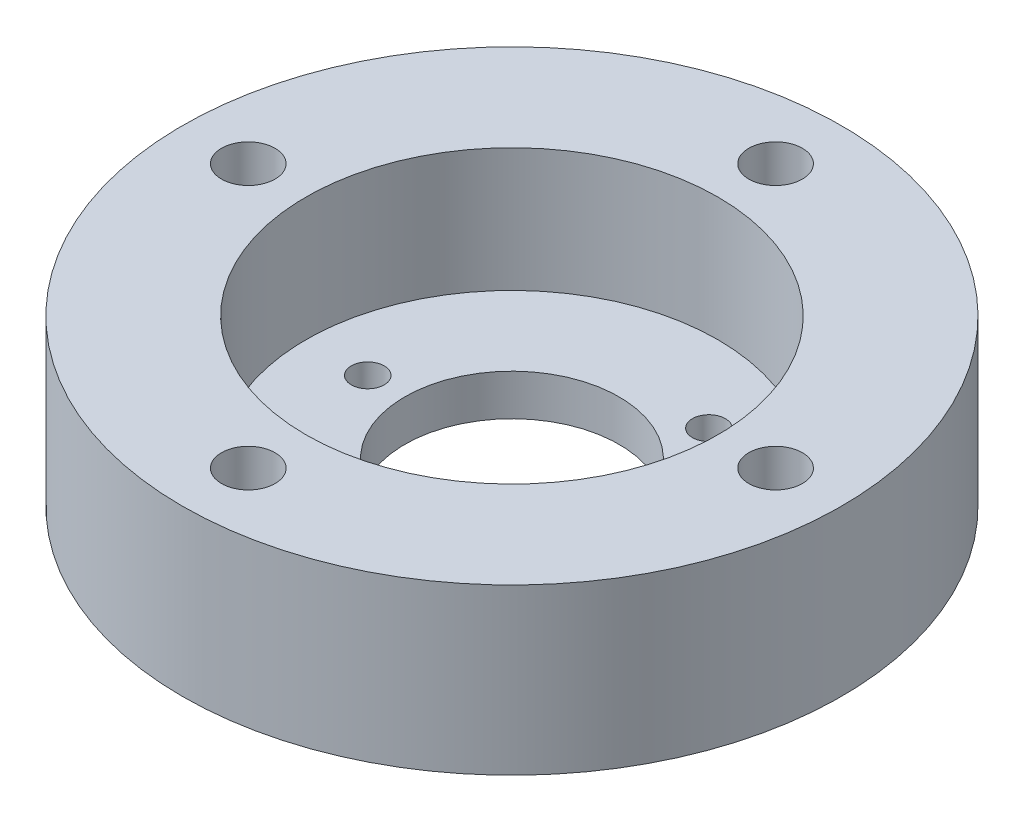
ISO-10303-21;
HEADER;
FILE_DESCRIPTION(('STEP AP214'),'2;1');
FILE_NAME('part.step','',(''),(''),'','','');
FILE_SCHEMA(('AUTOMOTIVE_DESIGN { 1 0 10303 214 1 1 1 1 }'));
ENDSEC;
DATA;
#1=APPLICATION_CONTEXT('core data for automotive mechanical design processes');
#2=APPLICATION_PROTOCOL_DEFINITION('international standard','automotive_design',2000,#1);
#3=PRODUCT_CONTEXT('',#1,'mechanical');
#4=PRODUCT('Part','Part','',(#3));
#5=PRODUCT_RELATED_PRODUCT_CATEGORY('part','',(#4));
#6=PRODUCT_DEFINITION_FORMATION('','',#4);
#7=PRODUCT_DEFINITION_CONTEXT('part definition',#1,'design');
#8=PRODUCT_DEFINITION('design','',#6,#7);
#9=PRODUCT_DEFINITION_SHAPE('','',#8);
#10=(LENGTH_UNIT() NAMED_UNIT(*) SI_UNIT(.MILLI.,.METRE.));
#11=(NAMED_UNIT(*) PLANE_ANGLE_UNIT() SI_UNIT($,.RADIAN.));
#12=(NAMED_UNIT(*) SI_UNIT($,.STERADIAN.) SOLID_ANGLE_UNIT());
#13=UNCERTAINTY_MEASURE_WITH_UNIT(LENGTH_MEASURE(1.E-05),#10,'distance_accuracy_value','');
#14=(GEOMETRIC_REPRESENTATION_CONTEXT(3) GLOBAL_UNCERTAINTY_ASSIGNED_CONTEXT((#13)) GLOBAL_UNIT_ASSIGNED_CONTEXT((#10,
#11,#12)) REPRESENTATION_CONTEXT('',''));
#15=CARTESIAN_POINT('',(0.,0.,0.));
#16=DIRECTION('',(0.,0.,1.));
#17=DIRECTION('',(1.,0.,0.));
#18=AXIS2_PLACEMENT_3D('',#15,#16,#17);
#19=CARTESIAN_POINT('',(40.,0.,0.));
#20=DIRECTION('',(0.,1.,0.));
#21=DIRECTION('',(0.,0.,1.));
#22=AXIS2_PLACEMENT_3D('',#19,#20,#21);
#23=PLANE('',#22);
#24=CARTESIAN_POINT('',(8.75000000000007,0.,15.1554445662276));
#25=DIRECTION('',(0.,1.,0.));
#26=DIRECTION('',(0.866025403784436,0.,-0.500000000000004));
#27=AXIS2_PLACEMENT_3D('',#24,#25,#26);
#28=CIRCLE('',#27,2.);
#29=CARTESIAN_POINT('',(10.4820508075689,0.,14.1554445662276));
#30=VERTEX_POINT('',#29);
#31=EDGE_CURVE('E63',#30,#30,#28,.T.);
#32=ORIENTED_EDGE('',*,*,#31,.T.);
#33=EDGE_LOOP('',(#32));
#34=FACE_BOUND('',#33,.T.);
#35=CARTESIAN_POINT('',(8.74999999999986,0.,-15.1554445662278));
#36=DIRECTION('',(0.,1.,0.));
#37=DIRECTION('',(-0.866025403784443,0.,-0.499999999999992));
#38=AXIS2_PLACEMENT_3D('',#35,#36,#37);
#39=CIRCLE('',#38,2.);
#40=CARTESIAN_POINT('',(7.01794919243097,0.,-16.1554445662277));
#41=VERTEX_POINT('',#40);
#42=EDGE_CURVE('E71',#41,#41,#39,.T.);
#43=ORIENTED_EDGE('',*,*,#42,.T.);
#44=EDGE_LOOP('',(#43));
#45=FACE_BOUND('',#44,.T.);
#46=CARTESIAN_POINT('',(-32.,0.,1.1172740284298E-13));
#47=DIRECTION('',(0.,1.,0.));
#48=DIRECTION('',(1.,0.,0.));
#49=AXIS2_PLACEMENT_3D('',#46,#47,#48);
#50=CIRCLE('',#49,3.25);
#51=CARTESIAN_POINT('',(-28.75,0.,1.0038008849174E-13));
#52=VERTEX_POINT('',#51);
#53=EDGE_CURVE('E79',#52,#52,#50,.T.);
#54=ORIENTED_EDGE('',*,*,#53,.T.);
#55=EDGE_LOOP('',(#54));
#56=FACE_BOUND('',#55,.T.);
#57=CARTESIAN_POINT('',(0.,0.,32.));
#58=DIRECTION('',(0.,1.,0.));
#59=DIRECTION('',(0.,0.,-1.));
#60=AXIS2_PLACEMENT_3D('',#57,#58,#59);
#61=CIRCLE('',#60,3.25);
#62=CARTESIAN_POINT('',(0.,0.,28.75));
#63=VERTEX_POINT('',#62);
#64=EDGE_CURVE('E88',#63,#63,#61,.T.);
#65=ORIENTED_EDGE('',*,*,#64,.T.);
#66=EDGE_LOOP('',(#65));
#67=FACE_BOUND('',#66,.T.);
#68=CARTESIAN_POINT('',(32.,0.,-3.35182208528941E-13));
#69=DIRECTION('',(0.,1.,0.));
#70=DIRECTION('',(-1.,0.,0.));
#71=AXIS2_PLACEMENT_3D('',#68,#69,#70);
#72=CIRCLE('',#71,3.25);
#73=CARTESIAN_POINT('',(28.75,0.,-3.0114026547522E-13));
#74=VERTEX_POINT('',#73);
#75=EDGE_CURVE('E96',#74,#74,#72,.T.);
#76=ORIENTED_EDGE('',*,*,#75,.T.);
#77=EDGE_LOOP('',(#76));
#78=FACE_BOUND('',#77,.T.);
#79=CARTESIAN_POINT('',(0.,0.,-32.));
#80=DIRECTION('',(0.,1.,0.));
#81=DIRECTION('',(0.,0.,1.));
#82=AXIS2_PLACEMENT_3D('',#79,#80,#81);
#83=CIRCLE('',#82,3.25);
#84=CARTESIAN_POINT('',(0.,0.,-28.75));
#85=VERTEX_POINT('',#84);
#86=EDGE_CURVE('E103',#85,#85,#83,.T.);
#87=ORIENTED_EDGE('',*,*,#86,.T.);
#88=EDGE_LOOP('',(#87));
#89=FACE_BOUND('',#88,.T.);
#90=CARTESIAN_POINT('',(-17.5,0.,0.));
#91=DIRECTION('',(0.,1.,0.));
#92=DIRECTION('',(0.,0.,1.));
#93=AXIS2_PLACEMENT_3D('',#90,#91,#92);
#94=CIRCLE('',#93,2.);
#95=CARTESIAN_POINT('',(-17.5,0.,2.));
#96=VERTEX_POINT('',#95);
#97=EDGE_CURVE('E59',#96,#96,#94,.T.);
#98=ORIENTED_EDGE('',*,*,#97,.T.);
#99=EDGE_LOOP('',(#98));
#100=FACE_BOUND('',#99,.T.);
#101=CARTESIAN_POINT('',(0.,0.,0.));
#102=DIRECTION('',(0.,1.,0.));
#103=DIRECTION('',(0.,0.,1.));
#104=AXIS2_PLACEMENT_3D('',#101,#102,#103);
#105=CIRCLE('',#104,40.);
#106=CARTESIAN_POINT('',(0.,0.,40.));
#107=VERTEX_POINT('',#106);
#108=EDGE_CURVE('E58',#107,#107,#105,.T.);
#109=ORIENTED_EDGE('',*,*,#108,.F.);
#110=EDGE_LOOP('',(#109));
#111=FACE_BOUND('',#110,.T.);
#112=CARTESIAN_POINT('',(0.,0.,0.));
#113=DIRECTION('',(0.,1.,0.));
#114=DIRECTION('',(0.,0.,1.));
#115=AXIS2_PLACEMENT_3D('',#112,#113,#114);
#116=CIRCLE('',#115,13.);
#117=CARTESIAN_POINT('',(0.,0.,13.));
#118=VERTEX_POINT('',#117);
#119=EDGE_CURVE('E10',#118,#118,#116,.T.);
#120=ORIENTED_EDGE('',*,*,#119,.T.);
#121=EDGE_LOOP('',(#120));
#122=FACE_BOUND('',#121,.T.);
#123=ADVANCED_FACE('F37',(#34,#45,#56,#67,#78,#89,#100,#111,#122),#23,.F.);
#124=CARTESIAN_POINT('',(0.,51.3950934422261,0.));
#125=DIRECTION('',(0.,1.,0.));
#126=DIRECTION('',(0.,0.,1.));
#127=AXIS2_PLACEMENT_3D('',#124,#125,#126);
#128=CYLINDRICAL_SURFACE('',#127,13.);
#129=ORIENTED_EDGE('',*,*,#119,.F.);
#130=EDGE_LOOP('',(#129));
#131=FACE_BOUND('',#130,.T.);
#132=CARTESIAN_POINT('',(0.,5.,0.));
#133=DIRECTION('',(0.,1.,0.));
#134=DIRECTION('',(0.,0.,1.));
#135=AXIS2_PLACEMENT_3D('',#132,#133,#134);
#136=CIRCLE('',#135,13.);
#137=CARTESIAN_POINT('',(0.,5.,13.));
#138=VERTEX_POINT('',#137);
#139=EDGE_CURVE('E45',#138,#138,#136,.T.);
#140=ORIENTED_EDGE('',*,*,#139,.T.);
#141=EDGE_LOOP('',(#140));
#142=FACE_BOUND('',#141,.T.);
#143=ADVANCED_FACE('F150',(#131,#142),#128,.F.);
#144=CARTESIAN_POINT('',(13.,5.,0.));
#145=DIRECTION('',(0.,-1.,0.));
#146=DIRECTION('',(0.,0.,-1.));
#147=AXIS2_PLACEMENT_3D('',#144,#145,#146);
#148=PLANE('',#147);
#149=CARTESIAN_POINT('',(8.75000000000007,5.,15.1554445662276));
#150=DIRECTION('',(0.,-1.,0.));
#151=DIRECTION('',(0.,0.,-1.));
#152=AXIS2_PLACEMENT_3D('',#149,#150,#151);
#153=CIRCLE('',#152,2.);
#154=CARTESIAN_POINT('',(8.75000000000007,5.,13.1554445662276));
#155=VERTEX_POINT('',#154);
#156=EDGE_CURVE('E40',#155,#155,#153,.T.);
#157=ORIENTED_EDGE('',*,*,#156,.T.);
#158=EDGE_LOOP('',(#157));
#159=FACE_BOUND('',#158,.T.);
#160=CARTESIAN_POINT('',(8.74999999999986,5.,-15.1554445662278));
#161=DIRECTION('',(0.,-1.,0.));
#162=DIRECTION('',(0.,0.,-1.));
#163=AXIS2_PLACEMENT_3D('',#160,#161,#162);
#164=CIRCLE('',#163,2.);
#165=CARTESIAN_POINT('',(8.74999999999986,5.,-17.1554445662278));
#166=VERTEX_POINT('',#165);
#167=EDGE_CURVE('E60',#166,#166,#164,.T.);
#168=ORIENTED_EDGE('',*,*,#167,.T.);
#169=EDGE_LOOP('',(#168));
#170=FACE_BOUND('',#169,.T.);
#171=CARTESIAN_POINT('',(-17.5,5.,0.));
#172=DIRECTION('',(0.,-1.,0.));
#173=DIRECTION('',(0.,0.,-1.));
#174=AXIS2_PLACEMENT_3D('',#171,#172,#173);
#175=CIRCLE('',#174,2.);
#176=CARTESIAN_POINT('',(-17.5,5.,-2.));
#177=VERTEX_POINT('',#176);
#178=EDGE_CURVE('E55',#177,#177,#175,.T.);
#179=ORIENTED_EDGE('',*,*,#178,.T.);
#180=EDGE_LOOP('',(#179));
#181=FACE_BOUND('',#180,.T.);
#182=ORIENTED_EDGE('',*,*,#139,.F.);
#183=EDGE_LOOP('',(#182));
#184=FACE_BOUND('',#183,.T.);
#185=CARTESIAN_POINT('',(0.,5.,0.));
#186=DIRECTION('',(0.,1.,0.));
#187=DIRECTION('',(0.,0.,1.));
#188=AXIS2_PLACEMENT_3D('',#185,#186,#187);
#189=CIRCLE('',#188,25.);
#190=CARTESIAN_POINT('',(0.,5.,25.));
#191=VERTEX_POINT('',#190);
#192=EDGE_CURVE('E51',#191,#191,#189,.T.);
#193=ORIENTED_EDGE('',*,*,#192,.T.);
#194=EDGE_LOOP('',(#193));
#195=FACE_BOUND('',#194,.T.);
#196=ADVANCED_FACE('F127',(#159,#170,#181,#184,#195),#148,.F.);
#197=CARTESIAN_POINT('',(0.,51.3950934422261,0.));
#198=DIRECTION('',(0.,1.,0.));
#199=DIRECTION('',(0.,0.,1.));
#200=AXIS2_PLACEMENT_3D('',#197,#198,#199);
#201=CYLINDRICAL_SURFACE('',#200,25.);
#202=ORIENTED_EDGE('',*,*,#192,.F.);
#203=EDGE_LOOP('',(#202));
#204=FACE_BOUND('',#203,.T.);
#205=CARTESIAN_POINT('',(0.,20.,0.));
#206=DIRECTION('',(0.,1.,0.));
#207=DIRECTION('',(0.,0.,1.));
#208=AXIS2_PLACEMENT_3D('',#205,#206,#207);
#209=CIRCLE('',#208,25.);
#210=CARTESIAN_POINT('',(0.,20.,25.));
#211=VERTEX_POINT('',#210);
#212=EDGE_CURVE('E120',#211,#211,#209,.T.);
#213=ORIENTED_EDGE('',*,*,#212,.T.);
#214=EDGE_LOOP('',(#213));
#215=FACE_BOUND('',#214,.T.);
#216=ADVANCED_FACE('F129',(#204,#215),#201,.F.);
#217=CARTESIAN_POINT('',(25.,20.,0.));
#218=DIRECTION('',(0.,-1.,0.));
#219=DIRECTION('',(0.,0.,-1.));
#220=AXIS2_PLACEMENT_3D('',#217,#218,#219);
#221=PLANE('',#220);
#222=CARTESIAN_POINT('',(-32.,20.,1.1172740284298E-13));
#223=DIRECTION('',(0.,1.,0.));
#224=DIRECTION('',(1.,0.,0.));
#225=AXIS2_PLACEMENT_3D('',#222,#223,#224);
#226=CIRCLE('',#225,3.25);
#227=CARTESIAN_POINT('',(-28.75,20.,1.0038008849174E-13));
#228=VERTEX_POINT('',#227);
#229=EDGE_CURVE('E84',#228,#228,#226,.T.);
#230=ORIENTED_EDGE('',*,*,#229,.F.);
#231=EDGE_LOOP('',(#230));
#232=FACE_BOUND('',#231,.T.);
#233=CARTESIAN_POINT('',(0.,20.,32.));
#234=DIRECTION('',(0.,1.,0.));
#235=DIRECTION('',(0.,0.,-1.));
#236=AXIS2_PLACEMENT_3D('',#233,#234,#235);
#237=CIRCLE('',#236,3.25);
#238=CARTESIAN_POINT('',(0.,20.,28.75));
#239=VERTEX_POINT('',#238);
#240=EDGE_CURVE('E92',#239,#239,#237,.T.);
#241=ORIENTED_EDGE('',*,*,#240,.F.);
#242=EDGE_LOOP('',(#241));
#243=FACE_BOUND('',#242,.T.);
#244=CARTESIAN_POINT('',(32.,20.,-3.35182208528941E-13));
#245=DIRECTION('',(0.,1.,0.));
#246=DIRECTION('',(-1.,0.,0.));
#247=AXIS2_PLACEMENT_3D('',#244,#245,#246);
#248=CIRCLE('',#247,3.25);
#249=CARTESIAN_POINT('',(28.75,20.,-3.0114026547522E-13));
#250=VERTEX_POINT('',#249);
#251=EDGE_CURVE('E69',#250,#250,#248,.T.);
#252=ORIENTED_EDGE('',*,*,#251,.F.);
#253=EDGE_LOOP('',(#252));
#254=FACE_BOUND('',#253,.T.);
#255=CARTESIAN_POINT('',(0.,20.,-32.));
#256=DIRECTION('',(0.,1.,0.));
#257=DIRECTION('',(0.,0.,1.));
#258=AXIS2_PLACEMENT_3D('',#255,#256,#257);
#259=CIRCLE('',#258,3.25);
#260=CARTESIAN_POINT('',(0.,20.,-28.75));
#261=VERTEX_POINT('',#260);
#262=EDGE_CURVE('E83',#261,#261,#259,.T.);
#263=ORIENTED_EDGE('',*,*,#262,.F.);
#264=EDGE_LOOP('',(#263));
#265=FACE_BOUND('',#264,.T.);
#266=ORIENTED_EDGE('',*,*,#212,.F.);
#267=EDGE_LOOP('',(#266));
#268=FACE_BOUND('',#267,.T.);
#269=CARTESIAN_POINT('',(0.,20.,0.));
#270=DIRECTION('',(0.,1.,0.));
#271=DIRECTION('',(0.,0.,1.));
#272=AXIS2_PLACEMENT_3D('',#269,#270,#271);
#273=CIRCLE('',#272,40.);
#274=CARTESIAN_POINT('',(0.,20.,40.));
#275=VERTEX_POINT('',#274);
#276=EDGE_CURVE('E116',#275,#275,#273,.T.);
#277=ORIENTED_EDGE('',*,*,#276,.T.);
#278=EDGE_LOOP('',(#277));
#279=FACE_BOUND('',#278,.T.);
#280=ADVANCED_FACE('F132',(#232,#243,#254,#265,#268,#279),#221,.F.);
#281=CARTESIAN_POINT('',(0.,51.3950934422261,0.));
#282=DIRECTION('',(0.,1.,0.));
#283=DIRECTION('',(0.,0.,1.));
#284=AXIS2_PLACEMENT_3D('',#281,#282,#283);
#285=CYLINDRICAL_SURFACE('',#284,40.);
#286=ORIENTED_EDGE('',*,*,#276,.F.);
#287=EDGE_LOOP('',(#286));
#288=FACE_BOUND('',#287,.T.);
#289=ORIENTED_EDGE('',*,*,#108,.T.);
#290=EDGE_LOOP('',(#289));
#291=FACE_BOUND('',#290,.T.);
#292=ADVANCED_FACE('F138',(#288,#291),#285,.T.);
#293=CARTESIAN_POINT('',(-17.5,0.,0.));
#294=DIRECTION('',(0.,1.,0.));
#295=DIRECTION('',(0.,0.,1.));
#296=AXIS2_PLACEMENT_3D('',#293,#294,#295);
#297=CYLINDRICAL_SURFACE('',#296,2.);
#298=ORIENTED_EDGE('',*,*,#97,.F.);
#299=EDGE_LOOP('',(#298));
#300=FACE_BOUND('',#299,.T.);
#301=ORIENTED_EDGE('',*,*,#178,.F.);
#302=EDGE_LOOP('',(#301));
#303=FACE_BOUND('',#302,.T.);
#304=ADVANCED_FACE('F145',(#300,#303),#297,.F.);
#305=CARTESIAN_POINT('',(0.,0.,-32.));
#306=DIRECTION('',(0.,1.,0.));
#307=DIRECTION('',(0.,0.,1.));
#308=AXIS2_PLACEMENT_3D('',#305,#306,#307);
#309=CYLINDRICAL_SURFACE('',#308,3.25);
#310=ORIENTED_EDGE('',*,*,#86,.F.);
#311=EDGE_LOOP('',(#310));
#312=FACE_BOUND('',#311,.T.);
#313=ORIENTED_EDGE('',*,*,#262,.T.);
#314=EDGE_LOOP('',(#313));
#315=FACE_BOUND('',#314,.T.);
#316=ADVANCED_FACE('F170',(#312,#315),#309,.F.);
#317=CARTESIAN_POINT('',(32.,0.,-3.35182208528941E-13));
#318=DIRECTION('',(0.,1.,0.));
#319=DIRECTION('',(0.,0.,1.));
#320=AXIS2_PLACEMENT_3D('',#317,#318,#319);
#321=CYLINDRICAL_SURFACE('',#320,3.25);
#322=ORIENTED_EDGE('',*,*,#75,.F.);
#323=EDGE_LOOP('',(#322));
#324=FACE_BOUND('',#323,.T.);
#325=ORIENTED_EDGE('',*,*,#251,.T.);
#326=EDGE_LOOP('',(#325));
#327=FACE_BOUND('',#326,.T.);
#328=ADVANCED_FACE('F185',(#324,#327),#321,.F.);
#329=CARTESIAN_POINT('',(0.,0.,32.));
#330=DIRECTION('',(0.,1.,0.));
#331=DIRECTION('',(0.,0.,1.));
#332=AXIS2_PLACEMENT_3D('',#329,#330,#331);
#333=CYLINDRICAL_SURFACE('',#332,3.25);
#334=ORIENTED_EDGE('',*,*,#64,.F.);
#335=EDGE_LOOP('',(#334));
#336=FACE_BOUND('',#335,.T.);
#337=ORIENTED_EDGE('',*,*,#240,.T.);
#338=EDGE_LOOP('',(#337));
#339=FACE_BOUND('',#338,.T.);
#340=ADVANCED_FACE('F189',(#336,#339),#333,.F.);
#341=CARTESIAN_POINT('',(-32.,0.,1.1172740284298E-13));
#342=DIRECTION('',(0.,1.,0.));
#343=DIRECTION('',(0.,0.,1.));
#344=AXIS2_PLACEMENT_3D('',#341,#342,#343);
#345=CYLINDRICAL_SURFACE('',#344,3.25);
#346=ORIENTED_EDGE('',*,*,#53,.F.);
#347=EDGE_LOOP('',(#346));
#348=FACE_BOUND('',#347,.T.);
#349=ORIENTED_EDGE('',*,*,#229,.T.);
#350=EDGE_LOOP('',(#349));
#351=FACE_BOUND('',#350,.T.);
#352=ADVANCED_FACE('F193',(#348,#351),#345,.F.);
#353=CARTESIAN_POINT('',(8.74999999999986,0.,-15.1554445662278));
#354=DIRECTION('',(0.,1.,0.));
#355=DIRECTION('',(0.,0.,1.));
#356=AXIS2_PLACEMENT_3D('',#353,#354,#355);
#357=CYLINDRICAL_SURFACE('',#356,2.);
#358=ORIENTED_EDGE('',*,*,#42,.F.);
#359=EDGE_LOOP('',(#358));
#360=FACE_BOUND('',#359,.T.);
#361=ORIENTED_EDGE('',*,*,#167,.F.);
#362=EDGE_LOOP('',(#361));
#363=FACE_BOUND('',#362,.T.);
#364=ADVANCED_FACE('F197',(#360,#363),#357,.F.);
#365=CARTESIAN_POINT('',(8.75000000000007,0.,15.1554445662276));
#366=DIRECTION('',(0.,1.,0.));
#367=DIRECTION('',(0.,0.,1.));
#368=AXIS2_PLACEMENT_3D('',#365,#366,#367);
#369=CYLINDRICAL_SURFACE('',#368,2.);
#370=ORIENTED_EDGE('',*,*,#31,.F.);
#371=EDGE_LOOP('',(#370));
#372=FACE_BOUND('',#371,.T.);
#373=ORIENTED_EDGE('',*,*,#156,.F.);
#374=EDGE_LOOP('',(#373));
#375=FACE_BOUND('',#374,.T.);
#376=ADVANCED_FACE('F201',(#372,#375),#369,.F.);
#377=CLOSED_SHELL('',(#123,#143,#196,#216,#280,#292,#304,#316,#328,#340,#352,#364,#376));
#378=MANIFOLD_SOLID_BREP('B2',#377);
#379=ADVANCED_BREP_SHAPE_REPRESENTATION('',(#18,#378),#14);
#380=SHAPE_DEFINITION_REPRESENTATION(#9,#379);
ENDSEC;
END-ISO-10303-21;
